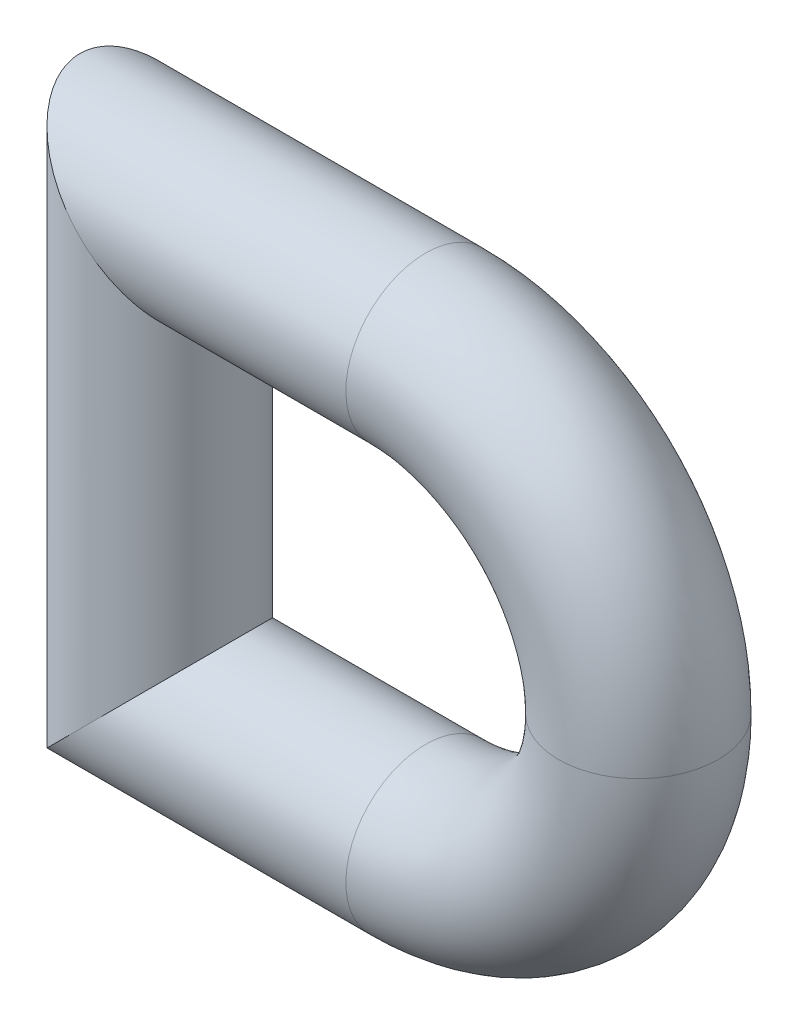
ISO-10303-21;
HEADER;
FILE_DESCRIPTION(('STEP AP214'),'2;1');
FILE_NAME('part.step','',(''),(''),'','','');
FILE_SCHEMA(('AUTOMOTIVE_DESIGN { 1 0 10303 214 1 1 1 1 }'));
ENDSEC;
DATA;
#1=APPLICATION_CONTEXT('core data for automotive mechanical design processes');
#2=APPLICATION_PROTOCOL_DEFINITION('international standard','automotive_design',2000,#1);
#3=PRODUCT_CONTEXT('',#1,'mechanical');
#4=PRODUCT('Part','Part','',(#3));
#5=PRODUCT_RELATED_PRODUCT_CATEGORY('part','',(#4));
#6=PRODUCT_DEFINITION_FORMATION('','',#4);
#7=PRODUCT_DEFINITION_CONTEXT('part definition',#1,'design');
#8=PRODUCT_DEFINITION('design','',#6,#7);
#9=PRODUCT_DEFINITION_SHAPE('','',#8);
#10=(LENGTH_UNIT() NAMED_UNIT(*) SI_UNIT(.MILLI.,.METRE.));
#11=(NAMED_UNIT(*) PLANE_ANGLE_UNIT() SI_UNIT($,.RADIAN.));
#12=(NAMED_UNIT(*) SI_UNIT($,.STERADIAN.) SOLID_ANGLE_UNIT());
#13=UNCERTAINTY_MEASURE_WITH_UNIT(LENGTH_MEASURE(1.E-05),#10,'distance_accuracy_value','');
#14=(GEOMETRIC_REPRESENTATION_CONTEXT(3) GLOBAL_UNCERTAINTY_ASSIGNED_CONTEXT((#13)) GLOBAL_UNIT_ASSIGNED_CONTEXT((#10,
#11,#12)) REPRESENTATION_CONTEXT('',''));
#15=CARTESIAN_POINT('',(0.,0.,0.));
#16=DIRECTION('',(0.,0.,1.));
#17=DIRECTION('',(1.,0.,0.));
#18=AXIS2_PLACEMENT_3D('',#15,#16,#17);
#19=CARTESIAN_POINT('',(10.,0.,0.));
#20=DIRECTION('',(0.,0.,1.));
#21=DIRECTION('',(1.,0.,0.));
#22=AXIS2_PLACEMENT_3D('',#19,#20,#21);
#23=TOROIDAL_SURFACE('',#22,8.,2.99999999999999);
#24=CARTESIAN_POINT('',(18.,0.,0.));
#25=DIRECTION('',(0.,1.,0.));
#26=DIRECTION('',(0.,0.,1.));
#27=AXIS2_PLACEMENT_3D('',#24,#25,#26);
#28=CIRCLE('',#27,2.99999999999999);
#29=CARTESIAN_POINT('',(21.,0.,0.));
#30=VERTEX_POINT('',#29);
#31=EDGE_CURVE('E52',#30,#30,#28,.T.);
#32=CARTESIAN_POINT('',(10.,8.,0.));
#33=DIRECTION('',(-1.,0.,0.));
#34=DIRECTION('',(0.,0.,1.));
#35=AXIS2_PLACEMENT_3D('',#32,#33,#34);
#36=CIRCLE('',#35,2.99999999999999);
#37=CARTESIAN_POINT('',(10.,11.,0.));
#38=VERTEX_POINT('',#37);
#39=EDGE_CURVE('E54',#38,#38,#36,.T.);
#40=CARTESIAN_POINT('',(10.,0.,0.));
#41=DIRECTION('',(0.,0.,1.));
#42=DIRECTION('',(1.,0.,0.));
#43=AXIS2_PLACEMENT_3D('',#40,#41,#42);
#44=CIRCLE('',#43,11.);
#45=EDGE_CURVE('',#30,#38,#44,.T.);
#46=ORIENTED_EDGE('',*,*,#31,.T.);
#47=ORIENTED_EDGE('',*,*,#39,.F.);
#48=ORIENTED_EDGE('',*,*,#45,.T.);
#49=ORIENTED_EDGE('',*,*,#45,.F.);
#50=EDGE_LOOP('',(#46,#48,#47,#49));
#51=FACE_BOUND('',#50,.T.);
#52=ADVANCED_FACE('F37',(#51),#23,.T.);
#53=CARTESIAN_POINT('',(10.,8.,0.));
#54=DIRECTION('',(-1.,0.,0.));
#55=DIRECTION('',(0.,0.,1.));
#56=AXIS2_PLACEMENT_3D('',#53,#54,#55);
#57=CYLINDRICAL_SURFACE('',#56,2.99999999999999);
#58=ORIENTED_EDGE('',*,*,#39,.T.);
#59=EDGE_LOOP('',(#58));
#60=FACE_BOUND('',#59,.T.);
#61=CARTESIAN_POINT('',(0.,8.,0.));
#62=DIRECTION('',(-0.707106781186548,-0.707106781186548,0.));
#63=DIRECTION('',(0.707106781186548,-0.707106781186548,0.));
#64=AXIS2_PLACEMENT_3D('',#61,#62,#63);
#65=ELLIPSE('',#64,4.24264068711928,2.99999999999999);
#66=CARTESIAN_POINT('',(2.99999999999999,5.00000000000001,0.));
#67=VERTEX_POINT('',#66);
#68=EDGE_CURVE('E45',#67,#67,#65,.F.);
#69=ORIENTED_EDGE('',*,*,#68,.T.);
#70=EDGE_LOOP('',(#69));
#71=FACE_BOUND('',#70,.T.);
#72=ADVANCED_FACE('F73',(#60,#71),#57,.T.);
#73=CARTESIAN_POINT('',(10.,0.,0.));
#74=DIRECTION('',(0.,0.,1.));
#75=DIRECTION('',(1.,0.,0.));
#76=AXIS2_PLACEMENT_3D('',#73,#74,#75);
#77=TOROIDAL_SURFACE('',#76,8.,2.99999999999999);
#78=CARTESIAN_POINT('',(10.,-8.,0.));
#79=DIRECTION('',(1.,0.,0.));
#80=DIRECTION('',(0.,0.,1.));
#81=AXIS2_PLACEMENT_3D('',#78,#79,#80);
#82=CIRCLE('',#81,2.99999999999999);
#83=CARTESIAN_POINT('',(10.,-11.,0.));
#84=VERTEX_POINT('',#83);
#85=EDGE_CURVE('E41',#84,#84,#82,.T.);
#86=CARTESIAN_POINT('',(10.,0.,0.));
#87=DIRECTION('',(0.,0.,1.));
#88=DIRECTION('',(1.,0.,0.));
#89=AXIS2_PLACEMENT_3D('',#86,#87,#88);
#90=CIRCLE('',#89,11.);
#91=EDGE_CURVE('',#84,#30,#90,.T.);
#92=ORIENTED_EDGE('',*,*,#85,.T.);
#93=ORIENTED_EDGE('',*,*,#31,.F.);
#94=ORIENTED_EDGE('',*,*,#91,.T.);
#95=ORIENTED_EDGE('',*,*,#91,.F.);
#96=EDGE_LOOP('',(#92,#94,#93,#95));
#97=FACE_BOUND('',#96,.T.);
#98=ADVANCED_FACE('F61',(#97),#77,.T.);
#99=CARTESIAN_POINT('',(-6.69999999999999,-8.,0.));
#100=DIRECTION('',(1.,0.,0.));
#101=DIRECTION('',(0.,0.,-1.));
#102=AXIS2_PLACEMENT_3D('',#99,#100,#101);
#103=CYLINDRICAL_SURFACE('',#102,2.99999999999999);
#104=CARTESIAN_POINT('',(0.,-8.,0.));
#105=DIRECTION('',(0.707106781186548,-0.707106781186547,0.));
#106=DIRECTION('',(-0.707106781186547,-0.707106781186548,0.));
#107=AXIS2_PLACEMENT_3D('',#104,#105,#106);
#108=ELLIPSE('',#107,4.24264068711928,2.99999999999999);
#109=CARTESIAN_POINT('',(-2.99999999999999,-11.,0.));
#110=VERTEX_POINT('',#109);
#111=EDGE_CURVE('E10',#110,#110,#108,.F.);
#112=ORIENTED_EDGE('',*,*,#111,.F.);
#113=EDGE_LOOP('',(#112));
#114=FACE_BOUND('',#113,.T.);
#115=ORIENTED_EDGE('',*,*,#85,.F.);
#116=EDGE_LOOP('',(#115));
#117=FACE_BOUND('',#116,.T.);
#118=ADVANCED_FACE('F39',(#114,#117),#103,.T.);
#119=CARTESIAN_POINT('',(0.,14.7,0.));
#120=DIRECTION('',(0.,-1.,0.));
#121=DIRECTION('',(1.,0.,0.));
#122=AXIS2_PLACEMENT_3D('',#119,#120,#121);
#123=CYLINDRICAL_SURFACE('',#122,2.99999999999999);
#124=ORIENTED_EDGE('',*,*,#68,.F.);
#125=EDGE_LOOP('',(#124));
#126=FACE_BOUND('',#125,.T.);
#127=ORIENTED_EDGE('',*,*,#111,.T.);
#128=EDGE_LOOP('',(#127));
#129=FACE_BOUND('',#128,.T.);
#130=ADVANCED_FACE('F65',(#126,#129),#123,.T.);
#131=CLOSED_SHELL('',(#52,#72,#98,#118,#130));
#132=MANIFOLD_SOLID_BREP('B2',#131);
#133=ADVANCED_BREP_SHAPE_REPRESENTATION('',(#18,#132),#14);
#134=SHAPE_DEFINITION_REPRESENTATION(#9,#133);
ENDSEC;
END-ISO-10303-21;
